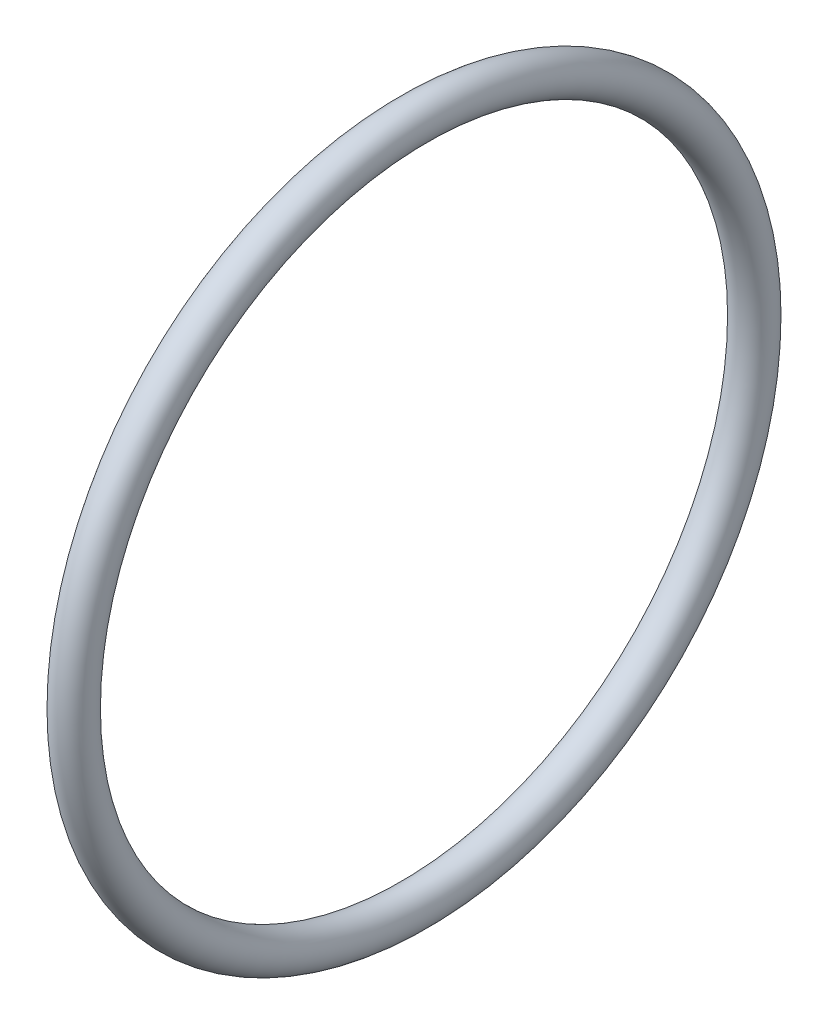
ISO-10303-21;
HEADER;
FILE_DESCRIPTION(('STEP AP214'),'2;1');
FILE_NAME('part.step','',(''),(''),'','','');
FILE_SCHEMA(('AUTOMOTIVE_DESIGN { 1 0 10303 214 1 1 1 1 }'));
ENDSEC;
DATA;
#1=APPLICATION_CONTEXT('core data for automotive mechanical design processes');
#2=APPLICATION_PROTOCOL_DEFINITION('international standard','automotive_design',2000,#1);
#3=PRODUCT_CONTEXT('',#1,'mechanical');
#4=PRODUCT('Part','Part','',(#3));
#5=PRODUCT_RELATED_PRODUCT_CATEGORY('part','',(#4));
#6=PRODUCT_DEFINITION_FORMATION('','',#4);
#7=PRODUCT_DEFINITION_CONTEXT('part definition',#1,'design');
#8=PRODUCT_DEFINITION('design','',#6,#7);
#9=PRODUCT_DEFINITION_SHAPE('','',#8);
#10=(LENGTH_UNIT() NAMED_UNIT(*) SI_UNIT(.MILLI.,.METRE.));
#11=(NAMED_UNIT(*) PLANE_ANGLE_UNIT() SI_UNIT($,.RADIAN.));
#12=(NAMED_UNIT(*) SI_UNIT($,.STERADIAN.) SOLID_ANGLE_UNIT());
#13=UNCERTAINTY_MEASURE_WITH_UNIT(LENGTH_MEASURE(1.E-05),#10,'distance_accuracy_value','');
#14=(GEOMETRIC_REPRESENTATION_CONTEXT(3) GLOBAL_UNCERTAINTY_ASSIGNED_CONTEXT((#13)) GLOBAL_UNIT_ASSIGNED_CONTEXT((#10,
#11,#12)) REPRESENTATION_CONTEXT('',''));
#15=CARTESIAN_POINT('',(0.,0.,0.));
#16=DIRECTION('',(0.,0.,1.));
#17=DIRECTION('',(1.,0.,0.));
#18=AXIS2_PLACEMENT_3D('',#15,#16,#17);
#19=CARTESIAN_POINT('',(75.,0.,0.));
#20=DIRECTION('',(-1.,0.,0.));
#21=DIRECTION('',(0.,0.,-1.));
#22=AXIS2_PLACEMENT_3D('',#19,#20,#21);
#23=TOROIDAL_SURFACE('',#22,72.,4.);
#24=CARTESIAN_POINT('',(75.,62.3538290724795,-36.));
#25=DIRECTION('',(0.,0.500000000000001,0.866025403784438));
#26=DIRECTION('',(0.,0.866025403784438,-0.500000000000001));
#27=AXIS2_PLACEMENT_3D('',#24,#25,#26);
#28=CIRCLE('',#27,4.);
#29=CARTESIAN_POINT('',(75.,65.8179306876173,-38.0000000000001));
#30=VERTEX_POINT('',#29);
#31=EDGE_CURVE('E10',#30,#30,#28,.T.);
#32=CARTESIAN_POINT('',(75.,0.,0.));
#33=DIRECTION('',(-1.,0.,0.));
#34=DIRECTION('',(0.,0.,-1.));
#35=AXIS2_PLACEMENT_3D('',#32,#33,#34);
#36=CIRCLE('',#35,76.);
#37=EDGE_CURVE('',#30,#30,#36,.T.);
#38=ORIENTED_EDGE('',*,*,#31,.F.);
#39=ORIENTED_EDGE('',*,*,#31,.T.);
#40=ORIENTED_EDGE('',*,*,#37,.T.);
#41=ORIENTED_EDGE('',*,*,#37,.F.);
#42=EDGE_LOOP('',(#38,#40,#39,#41));
#43=FACE_BOUND('',#42,.T.);
#44=ADVANCED_FACE('F39',(#43),#23,.T.);
#45=CLOSED_SHELL('',(#44));
#46=MANIFOLD_SOLID_BREP('B2',#45);
#47=ADVANCED_BREP_SHAPE_REPRESENTATION('',(#18,#46),#14);
#48=SHAPE_DEFINITION_REPRESENTATION(#9,#47);
ENDSEC;
END-ISO-10303-21;
